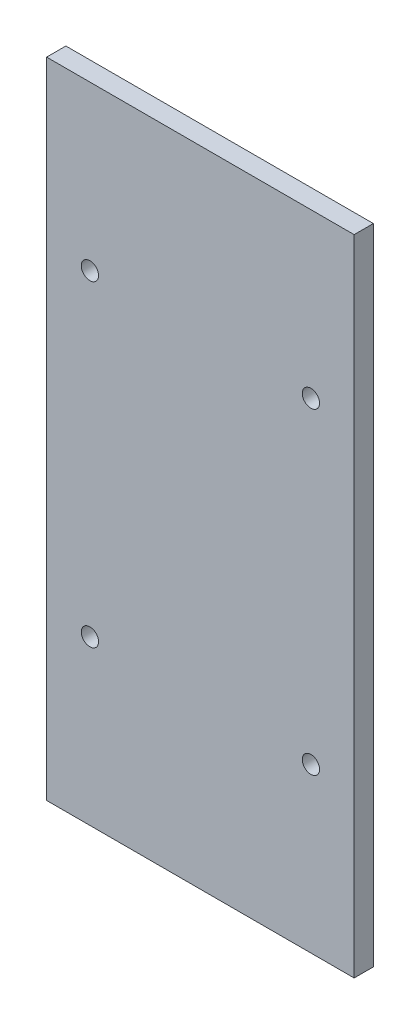
ISO-10303-21;
HEADER;
FILE_DESCRIPTION(('STEP AP214'),'2;1');
FILE_NAME('part.step','',(''),(''),'','','');
FILE_SCHEMA(('AUTOMOTIVE_DESIGN { 1 0 10303 214 1 1 1 1 }'));
ENDSEC;
DATA;
#1=APPLICATION_CONTEXT('core data for automotive mechanical design processes');
#2=APPLICATION_PROTOCOL_DEFINITION('international standard','automotive_design',2000,#1);
#3=PRODUCT_CONTEXT('',#1,'mechanical');
#4=PRODUCT('Part','Part','',(#3));
#5=PRODUCT_RELATED_PRODUCT_CATEGORY('part','',(#4));
#6=PRODUCT_DEFINITION_FORMATION('','',#4);
#7=PRODUCT_DEFINITION_CONTEXT('part definition',#1,'design');
#8=PRODUCT_DEFINITION('design','',#6,#7);
#9=PRODUCT_DEFINITION_SHAPE('','',#8);
#10=(LENGTH_UNIT() NAMED_UNIT(*) SI_UNIT(.MILLI.,.METRE.));
#11=(NAMED_UNIT(*) PLANE_ANGLE_UNIT() SI_UNIT($,.RADIAN.));
#12=(NAMED_UNIT(*) SI_UNIT($,.STERADIAN.) SOLID_ANGLE_UNIT());
#13=UNCERTAINTY_MEASURE_WITH_UNIT(LENGTH_MEASURE(1.E-05),#10,'distance_accuracy_value','');
#14=(GEOMETRIC_REPRESENTATION_CONTEXT(3) GLOBAL_UNCERTAINTY_ASSIGNED_CONTEXT((#13)) GLOBAL_UNIT_ASSIGNED_CONTEXT((#10,
#11,#12)) REPRESENTATION_CONTEXT('',''));
#15=CARTESIAN_POINT('',(0.,0.,0.));
#16=DIRECTION('',(0.,0.,1.));
#17=DIRECTION('',(1.,0.,0.));
#18=AXIS2_PLACEMENT_3D('',#15,#16,#17);
#19=CARTESIAN_POINT('',(-60.,59.9999999999999,20.));
#20=DIRECTION('',(1.,0.,0.));
#21=DIRECTION('',(0.,1.,0.));
#22=AXIS2_PLACEMENT_3D('',#19,#20,#21);
#23=PLANE('',#22);
#24=DIRECTION('',(0.,-1.,0.));
#25=VECTOR('',#24,1.);
#26=CARTESIAN_POINT('',(-60.,59.9999999999999,0.));
#27=LINE('',#26,#25);
#28=CARTESIAN_POINT('',(-60.,59.9999999999999,0.));
#29=VERTEX_POINT('',#28);
#30=CARTESIAN_POINT('',(-59.9999999999999,-610.,0.));
#31=VERTEX_POINT('',#30);
#32=EDGE_CURVE('E95',#29,#31,#27,.T.);
#33=ORIENTED_EDGE('',*,*,#32,.T.);
#34=DIRECTION('',(0.,0.,-1.));
#35=VECTOR('',#34,1.);
#36=CARTESIAN_POINT('',(-59.9999999999999,-610.,20.));
#37=LINE('',#36,#35);
#38=CARTESIAN_POINT('',(-59.9999999999999,-610.,20.));
#39=VERTEX_POINT('',#38);
#40=EDGE_CURVE('E11',#39,#31,#37,.T.);
#41=ORIENTED_EDGE('',*,*,#40,.F.);
#42=DIRECTION('',(0.,-1.,0.));
#43=VECTOR('',#42,1.);
#44=CARTESIAN_POINT('',(-60.,59.9999999999999,20.));
#45=LINE('',#44,#43);
#46=CARTESIAN_POINT('',(-60.,59.9999999999999,20.));
#47=VERTEX_POINT('',#46);
#48=EDGE_CURVE('E81',#47,#39,#45,.T.);
#49=ORIENTED_EDGE('',*,*,#48,.F.);
#50=DIRECTION('',(0.,0.,-1.));
#51=VECTOR('',#50,1.);
#52=CARTESIAN_POINT('',(-60.,59.9999999999999,20.));
#53=LINE('',#52,#51);
#54=EDGE_CURVE('E48',#47,#29,#53,.T.);
#55=ORIENTED_EDGE('',*,*,#54,.T.);
#56=EDGE_LOOP('',(#33,#41,#49,#55));
#57=FACE_BOUND('',#56,.T.);
#58=ADVANCED_FACE('F32',(#57),#23,.F.);
#59=CARTESIAN_POINT('',(-59.9999999999999,-610.,20.));
#60=DIRECTION('',(0.,1.,0.));
#61=DIRECTION('',(0.,0.,1.));
#62=AXIS2_PLACEMENT_3D('',#59,#60,#61);
#63=PLANE('',#62);
#64=DIRECTION('',(1.,0.,0.));
#65=VECTOR('',#64,1.);
#66=CARTESIAN_POINT('',(-59.9999999999999,-610.,0.));
#67=LINE('',#66,#65);
#68=CARTESIAN_POINT('',(260.,-610.,0.));
#69=VERTEX_POINT('',#68);
#70=EDGE_CURVE('E86',#31,#69,#67,.T.);
#71=ORIENTED_EDGE('',*,*,#70,.T.);
#72=DIRECTION('',(0.,0.,-1.));
#73=VECTOR('',#72,1.);
#74=CARTESIAN_POINT('',(260.,-610.,20.));
#75=LINE('',#74,#73);
#76=CARTESIAN_POINT('',(260.,-610.,20.));
#77=VERTEX_POINT('',#76);
#78=EDGE_CURVE('E40',#77,#69,#75,.T.);
#79=ORIENTED_EDGE('',*,*,#78,.F.);
#80=DIRECTION('',(1.,0.,0.));
#81=VECTOR('',#80,1.);
#82=CARTESIAN_POINT('',(-59.9999999999999,-610.,20.));
#83=LINE('',#82,#81);
#84=EDGE_CURVE('E73',#39,#77,#83,.T.);
#85=ORIENTED_EDGE('',*,*,#84,.F.);
#86=ORIENTED_EDGE('',*,*,#40,.T.);
#87=EDGE_LOOP('',(#71,#79,#85,#86));
#88=FACE_BOUND('',#87,.T.);
#89=ADVANCED_FACE('F85',(#88),#63,.F.);
#90=CARTESIAN_POINT('',(260.,59.9999999999999,20.));
#91=DIRECTION('',(1.,0.,0.));
#92=DIRECTION('',(0.,1.,0.));
#93=AXIS2_PLACEMENT_3D('',#90,#91,#92);
#94=PLANE('',#93);
#95=DIRECTION('',(0.,-1.,0.));
#96=VECTOR('',#95,1.);
#97=CARTESIAN_POINT('',(260.,59.9999999999999,0.));
#98=LINE('',#97,#96);
#99=CARTESIAN_POINT('',(260.,59.9999999999999,0.));
#100=VERTEX_POINT('',#99);
#101=EDGE_CURVE('E99',#100,#69,#98,.T.);
#102=ORIENTED_EDGE('',*,*,#101,.F.);
#103=DIRECTION('',(0.,0.,-1.));
#104=VECTOR('',#103,1.);
#105=CARTESIAN_POINT('',(260.,59.9999999999999,20.));
#106=LINE('',#105,#104);
#107=CARTESIAN_POINT('',(260.,59.9999999999999,20.));
#108=VERTEX_POINT('',#107);
#109=EDGE_CURVE('E62',#108,#100,#106,.T.);
#110=ORIENTED_EDGE('',*,*,#109,.F.);
#111=DIRECTION('',(0.,-1.,0.));
#112=VECTOR('',#111,1.);
#113=CARTESIAN_POINT('',(260.,59.9999999999999,20.));
#114=LINE('',#113,#112);
#115=EDGE_CURVE('E80',#108,#77,#114,.T.);
#116=ORIENTED_EDGE('',*,*,#115,.T.);
#117=ORIENTED_EDGE('',*,*,#78,.T.);
#118=EDGE_LOOP('',(#102,#110,#116,#117));
#119=FACE_BOUND('',#118,.T.);
#120=ADVANCED_FACE('F89',(#119),#94,.T.);
#121=CARTESIAN_POINT('',(-60.,59.9999999999999,20.));
#122=DIRECTION('',(0.,1.,0.));
#123=DIRECTION('',(0.,0.,1.));
#124=AXIS2_PLACEMENT_3D('',#121,#122,#123);
#125=PLANE('',#124);
#126=DIRECTION('',(1.,0.,0.));
#127=VECTOR('',#126,1.);
#128=CARTESIAN_POINT('',(-60.,59.9999999999999,0.));
#129=LINE('',#128,#127);
#130=EDGE_CURVE('E101',#29,#100,#129,.T.);
#131=ORIENTED_EDGE('',*,*,#130,.F.);
#132=ORIENTED_EDGE('',*,*,#54,.F.);
#133=DIRECTION('',(1.,0.,0.));
#134=VECTOR('',#133,1.);
#135=CARTESIAN_POINT('',(-60.,59.9999999999999,20.));
#136=LINE('',#135,#134);
#137=EDGE_CURVE('E90',#47,#108,#136,.T.);
#138=ORIENTED_EDGE('',*,*,#137,.T.);
#139=ORIENTED_EDGE('',*,*,#109,.T.);
#140=EDGE_LOOP('',(#131,#132,#138,#139));
#141=FACE_BOUND('',#140,.T.);
#142=ADVANCED_FACE('F143',(#141),#125,.T.);
#143=CARTESIAN_POINT('',(0.,0.,20.));
#144=DIRECTION('',(0.,0.,1.));
#145=DIRECTION('',(1.,0.,0.));
#146=AXIS2_PLACEMENT_3D('',#143,#144,#145);
#147=PLANE('',#146);
#148=CARTESIAN_POINT('',(215.,-110.,20.));
#149=DIRECTION('',(0.,0.,1.));
#150=DIRECTION('',(1.,0.,0.));
#151=AXIS2_PLACEMENT_3D('',#148,#149,#150);
#152=CIRCLE('',#151,9.00000000000001);
#153=CARTESIAN_POINT('',(224.,-110.,20.));
#154=VERTEX_POINT('',#153);
#155=EDGE_CURVE('E125',#154,#154,#152,.T.);
#156=ORIENTED_EDGE('',*,*,#155,.F.);
#157=EDGE_LOOP('',(#156));
#158=FACE_BOUND('',#157,.T.);
#159=CARTESIAN_POINT('',(-14.9999999999999,-110.,20.));
#160=DIRECTION('',(0.,0.,1.));
#161=DIRECTION('',(1.,0.,0.));
#162=AXIS2_PLACEMENT_3D('',#159,#160,#161);
#163=CIRCLE('',#162,9.00000000000001);
#164=CARTESIAN_POINT('',(-5.99999999999989,-110.,20.));
#165=VERTEX_POINT('',#164);
#166=EDGE_CURVE('E119',#165,#165,#163,.T.);
#167=ORIENTED_EDGE('',*,*,#166,.F.);
#168=EDGE_LOOP('',(#167));
#169=FACE_BOUND('',#168,.T.);
#170=CARTESIAN_POINT('',(-15.,-440.,20.));
#171=DIRECTION('',(0.,0.,1.));
#172=DIRECTION('',(1.,0.,0.));
#173=AXIS2_PLACEMENT_3D('',#170,#171,#172);
#174=CIRCLE('',#173,9.00000000000001);
#175=CARTESIAN_POINT('',(-6.,-440.,20.));
#176=VERTEX_POINT('',#175);
#177=EDGE_CURVE('E113',#176,#176,#174,.T.);
#178=ORIENTED_EDGE('',*,*,#177,.F.);
#179=EDGE_LOOP('',(#178));
#180=FACE_BOUND('',#179,.T.);
#181=CARTESIAN_POINT('',(215.,-440.,20.));
#182=DIRECTION('',(0.,0.,1.));
#183=DIRECTION('',(1.,0.,0.));
#184=AXIS2_PLACEMENT_3D('',#181,#182,#183);
#185=CIRCLE('',#184,9.00000000000001);
#186=CARTESIAN_POINT('',(224.,-440.,20.));
#187=VERTEX_POINT('',#186);
#188=EDGE_CURVE('E107',#187,#187,#185,.T.);
#189=ORIENTED_EDGE('',*,*,#188,.F.);
#190=EDGE_LOOP('',(#189));
#191=FACE_BOUND('',#190,.T.);
#192=ORIENTED_EDGE('',*,*,#48,.T.);
#193=ORIENTED_EDGE('',*,*,#84,.T.);
#194=ORIENTED_EDGE('',*,*,#115,.F.);
#195=ORIENTED_EDGE('',*,*,#137,.F.);
#196=EDGE_LOOP('',(#192,#193,#194,#195));
#197=FACE_BOUND('',#196,.T.);
#198=ADVANCED_FACE('F77',(#158,#169,#180,#191,#197),#147,.T.);
#199=CARTESIAN_POINT('',(0.,0.,0.));
#200=DIRECTION('',(0.,0.,1.));
#201=DIRECTION('',(1.,0.,0.));
#202=AXIS2_PLACEMENT_3D('',#199,#200,#201);
#203=PLANE('',#202);
#204=CARTESIAN_POINT('',(215.,-110.,0.));
#205=DIRECTION('',(0.,0.,1.));
#206=DIRECTION('',(1.,0.,0.));
#207=AXIS2_PLACEMENT_3D('',#204,#205,#206);
#208=CIRCLE('',#207,9.00000000000001);
#209=CARTESIAN_POINT('',(224.,-110.,0.));
#210=VERTEX_POINT('',#209);
#211=EDGE_CURVE('E122',#210,#210,#208,.T.);
#212=ORIENTED_EDGE('',*,*,#211,.T.);
#213=EDGE_LOOP('',(#212));
#214=FACE_BOUND('',#213,.T.);
#215=CARTESIAN_POINT('',(-14.9999999999999,-110.,0.));
#216=DIRECTION('',(0.,0.,1.));
#217=DIRECTION('',(1.,0.,0.));
#218=AXIS2_PLACEMENT_3D('',#215,#216,#217);
#219=CIRCLE('',#218,9.00000000000001);
#220=CARTESIAN_POINT('',(-5.99999999999989,-110.,0.));
#221=VERTEX_POINT('',#220);
#222=EDGE_CURVE('E116',#221,#221,#219,.T.);
#223=ORIENTED_EDGE('',*,*,#222,.T.);
#224=EDGE_LOOP('',(#223));
#225=FACE_BOUND('',#224,.T.);
#226=CARTESIAN_POINT('',(-15.,-440.,0.));
#227=DIRECTION('',(0.,0.,1.));
#228=DIRECTION('',(1.,0.,0.));
#229=AXIS2_PLACEMENT_3D('',#226,#227,#228);
#230=CIRCLE('',#229,9.00000000000001);
#231=CARTESIAN_POINT('',(-6.,-440.,0.));
#232=VERTEX_POINT('',#231);
#233=EDGE_CURVE('E110',#232,#232,#230,.T.);
#234=ORIENTED_EDGE('',*,*,#233,.T.);
#235=EDGE_LOOP('',(#234));
#236=FACE_BOUND('',#235,.T.);
#237=CARTESIAN_POINT('',(215.,-440.,0.));
#238=DIRECTION('',(0.,0.,1.));
#239=DIRECTION('',(1.,0.,0.));
#240=AXIS2_PLACEMENT_3D('',#237,#238,#239);
#241=CIRCLE('',#240,9.00000000000001);
#242=CARTESIAN_POINT('',(224.,-440.,0.));
#243=VERTEX_POINT('',#242);
#244=EDGE_CURVE('E97',#243,#243,#241,.T.);
#245=ORIENTED_EDGE('',*,*,#244,.T.);
#246=EDGE_LOOP('',(#245));
#247=FACE_BOUND('',#246,.T.);
#248=ORIENTED_EDGE('',*,*,#32,.F.);
#249=ORIENTED_EDGE('',*,*,#130,.T.);
#250=ORIENTED_EDGE('',*,*,#101,.T.);
#251=ORIENTED_EDGE('',*,*,#70,.F.);
#252=EDGE_LOOP('',(#248,#249,#250,#251));
#253=FACE_BOUND('',#252,.T.);
#254=ADVANCED_FACE('F131',(#214,#225,#236,#247,#253),#203,.F.);
#255=CARTESIAN_POINT('',(215.,-440.,0.));
#256=DIRECTION('',(0.,0.,1.));
#257=DIRECTION('',(1.,0.,0.));
#258=AXIS2_PLACEMENT_3D('',#255,#256,#257);
#259=CYLINDRICAL_SURFACE('',#258,9.00000000000001);
#260=ORIENTED_EDGE('',*,*,#244,.F.);
#261=EDGE_LOOP('',(#260));
#262=FACE_BOUND('',#261,.T.);
#263=ORIENTED_EDGE('',*,*,#188,.T.);
#264=EDGE_LOOP('',(#263));
#265=FACE_BOUND('',#264,.T.);
#266=ADVANCED_FACE('F151',(#262,#265),#259,.F.);
#267=CARTESIAN_POINT('',(-15.,-440.,0.));
#268=DIRECTION('',(0.,0.,1.));
#269=DIRECTION('',(1.,0.,0.));
#270=AXIS2_PLACEMENT_3D('',#267,#268,#269);
#271=CYLINDRICAL_SURFACE('',#270,9.00000000000001);
#272=ORIENTED_EDGE('',*,*,#233,.F.);
#273=EDGE_LOOP('',(#272));
#274=FACE_BOUND('',#273,.T.);
#275=ORIENTED_EDGE('',*,*,#177,.T.);
#276=EDGE_LOOP('',(#275));
#277=FACE_BOUND('',#276,.T.);
#278=ADVANCED_FACE('F153',(#274,#277),#271,.F.);
#279=CARTESIAN_POINT('',(-14.9999999999999,-110.,0.));
#280=DIRECTION('',(0.,0.,1.));
#281=DIRECTION('',(1.,0.,0.));
#282=AXIS2_PLACEMENT_3D('',#279,#280,#281);
#283=CYLINDRICAL_SURFACE('',#282,9.00000000000001);
#284=ORIENTED_EDGE('',*,*,#222,.F.);
#285=EDGE_LOOP('',(#284));
#286=FACE_BOUND('',#285,.T.);
#287=ORIENTED_EDGE('',*,*,#166,.T.);
#288=EDGE_LOOP('',(#287));
#289=FACE_BOUND('',#288,.T.);
#290=ADVANCED_FACE('F137',(#286,#289),#283,.F.);
#291=CARTESIAN_POINT('',(215.,-110.,0.));
#292=DIRECTION('',(0.,0.,1.));
#293=DIRECTION('',(1.,0.,0.));
#294=AXIS2_PLACEMENT_3D('',#291,#292,#293);
#295=CYLINDRICAL_SURFACE('',#294,9.00000000000001);
#296=ORIENTED_EDGE('',*,*,#211,.F.);
#297=EDGE_LOOP('',(#296));
#298=FACE_BOUND('',#297,.T.);
#299=ORIENTED_EDGE('',*,*,#155,.T.);
#300=EDGE_LOOP('',(#299));
#301=FACE_BOUND('',#300,.T.);
#302=ADVANCED_FACE('F134',(#298,#301),#295,.F.);
#303=CLOSED_SHELL('',(#58,#89,#120,#142,#198,#254,#266,#278,#290,#302));
#304=MANIFOLD_SOLID_BREP('B2',#303);
#305=ADVANCED_BREP_SHAPE_REPRESENTATION('',(#18,#304),#14);
#306=SHAPE_DEFINITION_REPRESENTATION(#9,#305);
ENDSEC;
END-ISO-10303-21;
